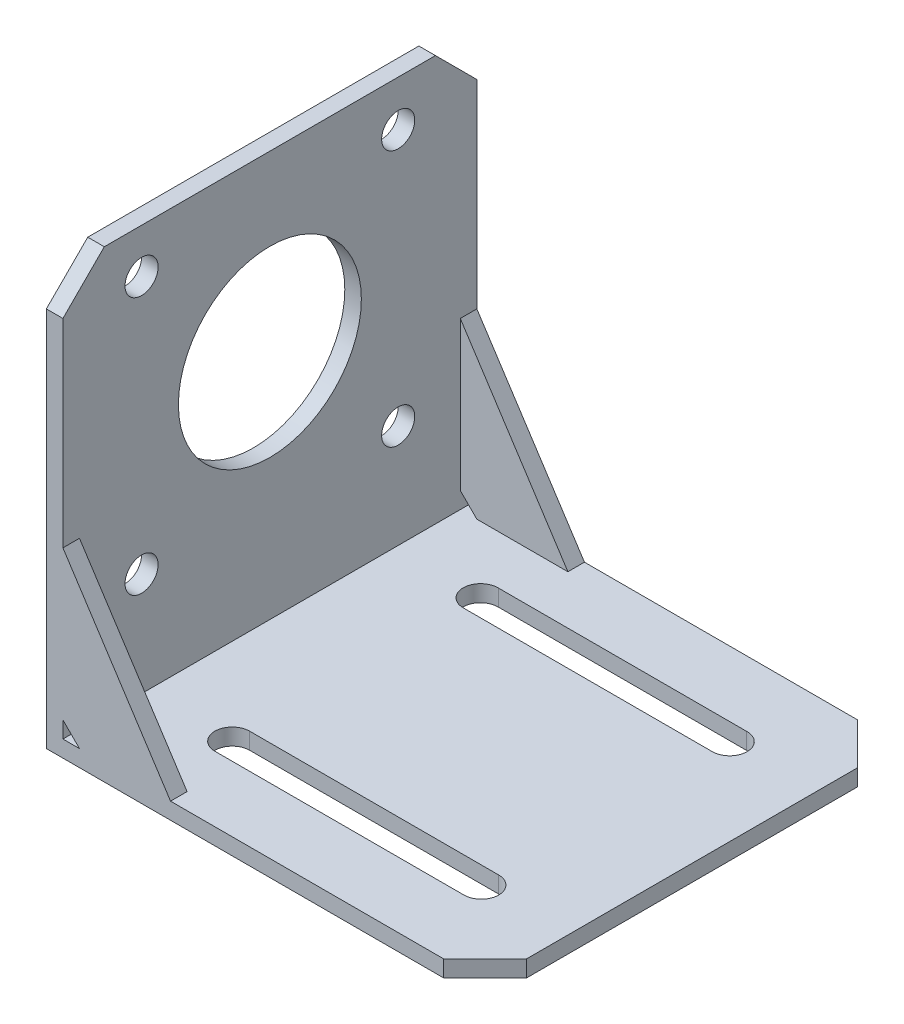
ISO-10303-21;
HEADER;
FILE_DESCRIPTION(('STEP AP214'),'2;1');
FILE_NAME('part.step','',(''),(''),'','','');
FILE_SCHEMA(('AUTOMOTIVE_DESIGN { 1 0 10303 214 1 1 1 1 }'));
ENDSEC;
DATA;
#1=APPLICATION_CONTEXT('core data for automotive mechanical design processes');
#2=APPLICATION_PROTOCOL_DEFINITION('international standard','automotive_design',2000,#1);
#3=PRODUCT_CONTEXT('',#1,'mechanical');
#4=PRODUCT('Part','Part','',(#3));
#5=PRODUCT_RELATED_PRODUCT_CATEGORY('part','',(#4));
#6=PRODUCT_DEFINITION_FORMATION('','',#4);
#7=PRODUCT_DEFINITION_CONTEXT('part definition',#1,'design');
#8=PRODUCT_DEFINITION('design','',#6,#7);
#9=PRODUCT_DEFINITION_SHAPE('','',#8);
#10=(LENGTH_UNIT() NAMED_UNIT(*) SI_UNIT(.MILLI.,.METRE.));
#11=(NAMED_UNIT(*) PLANE_ANGLE_UNIT() SI_UNIT($,.RADIAN.));
#12=(NAMED_UNIT(*) SI_UNIT($,.STERADIAN.) SOLID_ANGLE_UNIT());
#13=UNCERTAINTY_MEASURE_WITH_UNIT(LENGTH_MEASURE(1.E-05),#10,'distance_accuracy_value','');
#14=(GEOMETRIC_REPRESENTATION_CONTEXT(3) GLOBAL_UNCERTAINTY_ASSIGNED_CONTEXT((#13)) GLOBAL_UNIT_ASSIGNED_CONTEXT((#10,
#11,#12)) REPRESENTATION_CONTEXT('',''));
#15=CARTESIAN_POINT('',(0.,0.,0.));
#16=DIRECTION('',(0.,0.,1.));
#17=DIRECTION('',(1.,0.,0.));
#18=AXIS2_PLACEMENT_3D('',#15,#16,#17);
#19=CARTESIAN_POINT('',(53.,0.,50.));
#20=DIRECTION('',(0.,1.,0.));
#21=DIRECTION('',(-1.,0.,0.));
#22=AXIS2_PLACEMENT_3D('',#19,#20,#21);
#23=PLANE('',#22);
#24=DIRECTION('',(1.,0.,0.));
#25=VECTOR('',#24,1.);
#26=CARTESIAN_POINT('',(53.,0.,42.0995231668913));
#27=LINE('',#26,#25);
#28=CARTESIAN_POINT('',(12.5,0.,42.0995231668913));
#29=VERTEX_POINT('',#28);
#30=CARTESIAN_POINT('',(42.5,0.,42.0995231668913));
#31=VERTEX_POINT('',#30);
#32=EDGE_CURVE('E300',#29,#31,#27,.T.);
#33=ORIENTED_EDGE('',*,*,#32,.T.);
#34=CARTESIAN_POINT('',(42.5447489853135,0.,40.));
#35=DIRECTION('',(0.,1.,0.));
#36=DIRECTION('',(-1.,0.,0.));
#37=AXIS2_PLACEMENT_3D('',#34,#35,#36);
#38=CIRCLE('',#37,2.10000000000001);
#39=CARTESIAN_POINT('',(42.5447489853135,0.,37.9));
#40=VERTEX_POINT('',#39);
#41=EDGE_CURVE('E303',#31,#40,#38,.T.);
#42=ORIENTED_EDGE('',*,*,#41,.T.);
#43=DIRECTION('',(-1.,0.,0.));
#44=VECTOR('',#43,1.);
#45=CARTESIAN_POINT('',(53.,0.,37.9));
#46=LINE('',#45,#44);
#47=CARTESIAN_POINT('',(12.4552510146865,0.,37.9));
#48=VERTEX_POINT('',#47);
#49=EDGE_CURVE('E288',#40,#48,#46,.T.);
#50=ORIENTED_EDGE('',*,*,#49,.T.);
#51=CARTESIAN_POINT('',(12.4552510146873,0.,40.));
#52=DIRECTION('',(0.,1.,0.));
#53=DIRECTION('',(-1.,0.,0.));
#54=AXIS2_PLACEMENT_3D('',#51,#52,#53);
#55=CIRCLE('',#54,2.09999999999999);
#56=EDGE_CURVE('E297',#48,#29,#55,.T.);
#57=ORIENTED_EDGE('',*,*,#56,.T.);
#58=EDGE_LOOP('',(#33,#42,#50,#57));
#59=FACE_BOUND('',#58,.T.);
#60=DIRECTION('',(1.,0.,0.));
#61=VECTOR('',#60,1.);
#62=CARTESIAN_POINT('',(53.,0.,12.1));
#63=LINE('',#62,#61);
#64=CARTESIAN_POINT('',(12.4552510146865,0.,12.1));
#65=VERTEX_POINT('',#64);
#66=CARTESIAN_POINT('',(42.5447489853135,0.,12.1));
#67=VERTEX_POINT('',#66);
#68=EDGE_CURVE('E332',#65,#67,#63,.T.);
#69=ORIENTED_EDGE('',*,*,#68,.T.);
#70=CARTESIAN_POINT('',(42.5447489853135,0.,10.));
#71=DIRECTION('',(0.,1.,0.));
#72=DIRECTION('',(-1.,0.,0.));
#73=AXIS2_PLACEMENT_3D('',#70,#71,#72);
#74=CIRCLE('',#73,2.1);
#75=CARTESIAN_POINT('',(42.5,0.,7.90047683310867));
#76=VERTEX_POINT('',#75);
#77=EDGE_CURVE('E335',#67,#76,#74,.T.);
#78=ORIENTED_EDGE('',*,*,#77,.T.);
#79=DIRECTION('',(-1.,0.,0.));
#80=VECTOR('',#79,1.);
#81=CARTESIAN_POINT('',(53.,0.,7.90047683310866));
#82=LINE('',#81,#80);
#83=CARTESIAN_POINT('',(12.5,0.,7.90047683310867));
#84=VERTEX_POINT('',#83);
#85=EDGE_CURVE('E320',#76,#84,#82,.T.);
#86=ORIENTED_EDGE('',*,*,#85,.T.);
#87=CARTESIAN_POINT('',(12.4552510146861,0.,10.));
#88=DIRECTION('',(0.,1.,0.));
#89=DIRECTION('',(-1.,0.,0.));
#90=AXIS2_PLACEMENT_3D('',#87,#88,#89);
#91=CIRCLE('',#90,2.1);
#92=EDGE_CURVE('E329',#84,#65,#91,.T.);
#93=ORIENTED_EDGE('',*,*,#92,.T.);
#94=EDGE_LOOP('',(#69,#78,#86,#93));
#95=FACE_BOUND('',#94,.T.);
#96=DIRECTION('',(0.,0.,-1.));
#97=VECTOR('',#96,1.);
#98=CARTESIAN_POINT('',(53.,0.,50.));
#99=LINE('',#98,#97);
#100=CARTESIAN_POINT('',(53.,0.,45.));
#101=VERTEX_POINT('',#100);
#102=CARTESIAN_POINT('',(53.,0.,4.99999999999999));
#103=VERTEX_POINT('',#102);
#104=EDGE_CURVE('E399',#101,#103,#99,.T.);
#105=ORIENTED_EDGE('',*,*,#104,.F.);
#106=DIRECTION('',(0.707106781186547,0.,-0.707106781186549));
#107=VECTOR('',#106,1.);
#108=CARTESIAN_POINT('',(48.,0.,50.));
#109=LINE('',#108,#107);
#110=CARTESIAN_POINT('',(48.,0.,50.));
#111=VERTEX_POINT('',#110);
#112=EDGE_CURVE('E419',#101,#111,#109,.F.);
#113=ORIENTED_EDGE('',*,*,#112,.T.);
#114=DIRECTION('',(1.,0.,0.));
#115=VECTOR('',#114,1.);
#116=CARTESIAN_POINT('',(53.,0.,50.));
#117=LINE('',#116,#115);
#118=CARTESIAN_POINT('',(0.,0.,50.));
#119=VERTEX_POINT('',#118);
#120=EDGE_CURVE('E368',#119,#111,#117,.T.);
#121=ORIENTED_EDGE('',*,*,#120,.F.);
#122=DIRECTION('',(0.,0.,-1.));
#123=VECTOR('',#122,1.);
#124=CARTESIAN_POINT('',(0.,0.,50.));
#125=LINE('',#124,#123);
#126=CARTESIAN_POINT('',(0.,0.,0.));
#127=VERTEX_POINT('',#126);
#128=EDGE_CURVE('E381',#119,#127,#125,.T.);
#129=ORIENTED_EDGE('',*,*,#128,.T.);
#130=DIRECTION('',(1.,0.,0.));
#131=VECTOR('',#130,1.);
#132=CARTESIAN_POINT('',(53.,0.,0.));
#133=LINE('',#132,#131);
#134=CARTESIAN_POINT('',(48.,0.,0.));
#135=VERTEX_POINT('',#134);
#136=EDGE_CURVE('E216',#127,#135,#133,.T.);
#137=ORIENTED_EDGE('',*,*,#136,.T.);
#138=DIRECTION('',(0.707106781186549,0.,0.707106781186547));
#139=VECTOR('',#138,1.);
#140=CARTESIAN_POINT('',(53.,0.,4.99999999999999));
#141=LINE('',#140,#139);
#142=EDGE_CURVE('E417',#135,#103,#141,.T.);
#143=ORIENTED_EDGE('',*,*,#142,.T.);
#144=EDGE_LOOP('',(#105,#113,#121,#129,#137,#143));
#145=FACE_BOUND('',#144,.T.);
#146=ADVANCED_FACE('F32',(#59,#95,#145),#23,.F.);
#147=CARTESIAN_POINT('',(53.,2.,50.));
#148=DIRECTION('',(-1.,0.,0.));
#149=DIRECTION('',(0.,-1.,0.));
#150=AXIS2_PLACEMENT_3D('',#147,#148,#149);
#151=PLANE('',#150);
#152=DIRECTION('',(0.,0.,-1.));
#153=VECTOR('',#152,1.);
#154=CARTESIAN_POINT('',(53.,2.,50.));
#155=LINE('',#154,#153);
#156=CARTESIAN_POINT('',(53.,2.,45.));
#157=VERTEX_POINT('',#156);
#158=CARTESIAN_POINT('',(53.,2.,4.99999999999999));
#159=VERTEX_POINT('',#158);
#160=EDGE_CURVE('E396',#157,#159,#155,.T.);
#161=ORIENTED_EDGE('',*,*,#160,.F.);
#162=DIRECTION('',(0.,-1.,0.));
#163=VECTOR('',#162,1.);
#164=CARTESIAN_POINT('',(53.,2.,45.));
#165=LINE('',#164,#163);
#166=EDGE_CURVE('E415',#157,#101,#165,.T.);
#167=ORIENTED_EDGE('',*,*,#166,.T.);
#168=ORIENTED_EDGE('',*,*,#104,.T.);
#169=DIRECTION('',(0.,1.,0.));
#170=VECTOR('',#169,1.);
#171=CARTESIAN_POINT('',(53.,2.,4.99999999999999));
#172=LINE('',#171,#170);
#173=EDGE_CURVE('E412',#103,#159,#172,.T.);
#174=ORIENTED_EDGE('',*,*,#173,.T.);
#175=EDGE_LOOP('',(#161,#167,#168,#174));
#176=FACE_BOUND('',#175,.T.);
#177=ADVANCED_FACE('F492',(#176),#151,.F.);
#178=CARTESIAN_POINT('',(1.99999999999999,2.,50.));
#179=DIRECTION('',(0.,-1.,0.));
#180=DIRECTION('',(0.,0.,-1.));
#181=AXIS2_PLACEMENT_3D('',#178,#179,#180);
#182=PLANE('',#181);
#183=DIRECTION('',(-1.,0.,0.));
#184=VECTOR('',#183,1.);
#185=CARTESIAN_POINT('',(1.99999999999999,2.,50.));
#186=LINE('',#185,#184);
#187=CARTESIAN_POINT('',(48.,2.,50.));
#188=VERTEX_POINT('',#187);
#189=CARTESIAN_POINT('',(15.,2.,50.));
#190=VERTEX_POINT('',#189);
#191=EDGE_CURVE('E373',#188,#190,#186,.T.);
#192=ORIENTED_EDGE('',*,*,#191,.F.);
#193=DIRECTION('',(-0.707106781186547,0.,0.707106781186549));
#194=VECTOR('',#193,1.);
#195=CARTESIAN_POINT('',(48.,2.,50.));
#196=LINE('',#195,#194);
#197=EDGE_CURVE('E410',#188,#157,#196,.F.);
#198=ORIENTED_EDGE('',*,*,#197,.T.);
#199=ORIENTED_EDGE('',*,*,#160,.T.);
#200=DIRECTION('',(-0.707106781186549,0.,-0.707106781186547));
#201=VECTOR('',#200,1.);
#202=CARTESIAN_POINT('',(53.,2.,4.99999999999999));
#203=LINE('',#202,#201);
#204=CARTESIAN_POINT('',(48.,2.,0.));
#205=VERTEX_POINT('',#204);
#206=EDGE_CURVE('E408',#159,#205,#203,.T.);
#207=ORIENTED_EDGE('',*,*,#206,.T.);
#208=DIRECTION('',(-1.,0.,0.));
#209=VECTOR('',#208,1.);
#210=CARTESIAN_POINT('',(1.99999999999999,2.,0.));
#211=LINE('',#210,#209);
#212=CARTESIAN_POINT('',(15.,2.,0.));
#213=VERTEX_POINT('',#212);
#214=EDGE_CURVE('E215',#205,#213,#211,.T.);
#215=ORIENTED_EDGE('',*,*,#214,.T.);
#216=DIRECTION('',(0.,0.,-1.));
#217=VECTOR('',#216,1.);
#218=CARTESIAN_POINT('',(15.,2.,2.));
#219=LINE('',#218,#217);
#220=CARTESIAN_POINT('',(15.,2.,2.));
#221=VERTEX_POINT('',#220);
#222=EDGE_CURVE('E240',#221,#213,#219,.T.);
#223=ORIENTED_EDGE('',*,*,#222,.F.);
#224=DIRECTION('',(-1.,0.,0.));
#225=VECTOR('',#224,1.);
#226=CARTESIAN_POINT('',(15.,2.,2.));
#227=LINE('',#226,#225);
#228=CARTESIAN_POINT('',(3.99999999999999,2.,2.));
#229=VERTEX_POINT('',#228);
#230=EDGE_CURVE('E224',#221,#229,#227,.T.);
#231=ORIENTED_EDGE('',*,*,#230,.T.);
#232=DIRECTION('',(0.,0.,-1.));
#233=VECTOR('',#232,1.);
#234=CARTESIAN_POINT('',(3.99999999999999,2.,2.));
#235=LINE('',#234,#233);
#236=CARTESIAN_POINT('',(3.99999999999999,2.,0.));
#237=VERTEX_POINT('',#236);
#238=EDGE_CURVE('E219',#229,#237,#235,.T.);
#239=ORIENTED_EDGE('',*,*,#238,.T.);
#240=CARTESIAN_POINT('',(1.99999999999999,2.,0.));
#241=VERTEX_POINT('',#240);
#242=EDGE_CURVE('E205',#237,#241,#211,.T.);
#243=ORIENTED_EDGE('',*,*,#242,.T.);
#244=DIRECTION('',(0.,0.,-1.));
#245=VECTOR('',#244,1.);
#246=CARTESIAN_POINT('',(1.99999999999999,2.,50.));
#247=LINE('',#246,#245);
#248=CARTESIAN_POINT('',(1.99999999999999,2.,50.));
#249=VERTEX_POINT('',#248);
#250=EDGE_CURVE('E394',#249,#241,#247,.T.);
#251=ORIENTED_EDGE('',*,*,#250,.F.);
#252=CARTESIAN_POINT('',(3.99999999999999,2.,50.));
#253=VERTEX_POINT('',#252);
#254=EDGE_CURVE('E371',#253,#249,#186,.T.);
#255=ORIENTED_EDGE('',*,*,#254,.F.);
#256=DIRECTION('',(0.,0.,1.));
#257=VECTOR('',#256,1.);
#258=CARTESIAN_POINT('',(3.99999999999999,2.,48.));
#259=LINE('',#258,#257);
#260=CARTESIAN_POINT('',(3.99999999999999,2.,48.));
#261=VERTEX_POINT('',#260);
#262=EDGE_CURVE('E267',#261,#253,#259,.T.);
#263=ORIENTED_EDGE('',*,*,#262,.F.);
#264=DIRECTION('',(1.,0.,0.));
#265=VECTOR('',#264,1.);
#266=CARTESIAN_POINT('',(3.99999999999999,2.,48.));
#267=LINE('',#266,#265);
#268=CARTESIAN_POINT('',(15.,2.,48.));
#269=VERTEX_POINT('',#268);
#270=EDGE_CURVE('E257',#261,#269,#267,.T.);
#271=ORIENTED_EDGE('',*,*,#270,.T.);
#272=DIRECTION('',(0.,0.,1.));
#273=VECTOR('',#272,1.);
#274=CARTESIAN_POINT('',(15.,2.,48.));
#275=LINE('',#274,#273);
#276=EDGE_CURVE('E263',#269,#190,#275,.T.);
#277=ORIENTED_EDGE('',*,*,#276,.T.);
#278=EDGE_LOOP('',(#192,#198,#199,#207,#215,#223,#231,#239,#243,#251,#255,#263,#271,#277));
#279=FACE_BOUND('',#278,.T.);
#280=DIRECTION('',(-1.,0.,0.));
#281=VECTOR('',#280,1.);
#282=CARTESIAN_POINT('',(12.4552510146865,2.,37.9));
#283=LINE('',#282,#281);
#284=CARTESIAN_POINT('',(42.5447489853135,2.,37.9));
#285=VERTEX_POINT('',#284);
#286=CARTESIAN_POINT('',(12.4552510146865,2.,37.9));
#287=VERTEX_POINT('',#286);
#288=EDGE_CURVE('E276',#285,#287,#283,.T.);
#289=ORIENTED_EDGE('',*,*,#288,.F.);
#290=CARTESIAN_POINT('',(42.5447489853135,2.,40.));
#291=DIRECTION('',(0.,1.,0.));
#292=DIRECTION('',(0.,0.,-1.));
#293=AXIS2_PLACEMENT_3D('',#290,#291,#292);
#294=CIRCLE('',#293,2.10000000000001);
#295=CARTESIAN_POINT('',(42.5,2.,42.0995231668913));
#296=VERTEX_POINT('',#295);
#297=EDGE_CURVE('E266',#296,#285,#294,.T.);
#298=ORIENTED_EDGE('',*,*,#297,.F.);
#299=DIRECTION('',(1.,0.,0.));
#300=VECTOR('',#299,1.);
#301=CARTESIAN_POINT('',(12.5,2.,42.0995231668913));
#302=LINE('',#301,#300);
#303=CARTESIAN_POINT('',(12.5,2.,42.0995231668913));
#304=VERTEX_POINT('',#303);
#305=EDGE_CURVE('E282',#304,#296,#302,.T.);
#306=ORIENTED_EDGE('',*,*,#305,.F.);
#307=CARTESIAN_POINT('',(12.4552510146873,2.,40.));
#308=DIRECTION('',(0.,1.,0.));
#309=DIRECTION('',(0.,0.,-1.));
#310=AXIS2_PLACEMENT_3D('',#307,#308,#309);
#311=CIRCLE('',#310,2.09999999999999);
#312=EDGE_CURVE('E279',#287,#304,#311,.T.);
#313=ORIENTED_EDGE('',*,*,#312,.F.);
#314=EDGE_LOOP('',(#289,#298,#306,#313));
#315=FACE_BOUND('',#314,.T.);
#316=DIRECTION('',(-1.,0.,0.));
#317=VECTOR('',#316,1.);
#318=CARTESIAN_POINT('',(12.5,2.,7.90047683310867));
#319=LINE('',#318,#317);
#320=CARTESIAN_POINT('',(42.5,2.,7.90047683310866));
#321=VERTEX_POINT('',#320);
#322=CARTESIAN_POINT('',(12.5,2.,7.90047683310867));
#323=VERTEX_POINT('',#322);
#324=EDGE_CURVE('E308',#321,#323,#319,.T.);
#325=ORIENTED_EDGE('',*,*,#324,.F.);
#326=CARTESIAN_POINT('',(42.5447489853135,2.,10.));
#327=DIRECTION('',(0.,1.,0.));
#328=DIRECTION('',(0.,0.,-1.));
#329=AXIS2_PLACEMENT_3D('',#326,#327,#328);
#330=CIRCLE('',#329,2.1);
#331=CARTESIAN_POINT('',(42.5447489853135,2.,12.1));
#332=VERTEX_POINT('',#331);
#333=EDGE_CURVE('E306',#332,#321,#330,.T.);
#334=ORIENTED_EDGE('',*,*,#333,.F.);
#335=DIRECTION('',(1.,0.,0.));
#336=VECTOR('',#335,1.);
#337=CARTESIAN_POINT('',(12.4552510146865,2.,12.1));
#338=LINE('',#337,#336);
#339=CARTESIAN_POINT('',(12.4552510146865,2.,12.1));
#340=VERTEX_POINT('',#339);
#341=EDGE_CURVE('E314',#340,#332,#338,.T.);
#342=ORIENTED_EDGE('',*,*,#341,.F.);
#343=CARTESIAN_POINT('',(12.4552510146861,2.,10.));
#344=DIRECTION('',(0.,1.,0.));
#345=DIRECTION('',(0.,0.,-1.));
#346=AXIS2_PLACEMENT_3D('',#343,#344,#345);
#347=CIRCLE('',#346,2.1);
#348=EDGE_CURVE('E311',#323,#340,#347,.T.);
#349=ORIENTED_EDGE('',*,*,#348,.F.);
#350=EDGE_LOOP('',(#325,#334,#342,#349));
#351=FACE_BOUND('',#350,.T.);
#352=ADVANCED_FACE('F221',(#279,#315,#351),#182,.F.);
#353=CARTESIAN_POINT('',(1.99999999999999,51.,50.));
#354=DIRECTION('',(-1.,0.,0.));
#355=DIRECTION('',(0.,-1.,0.));
#356=AXIS2_PLACEMENT_3D('',#353,#354,#355);
#357=PLANE('',#356);
#358=DIRECTION('',(0.,0.,-1.));
#359=VECTOR('',#358,1.);
#360=CARTESIAN_POINT('',(1.99999999999999,51.,50.));
#361=LINE('',#360,#359);
#362=CARTESIAN_POINT('',(1.99999999999999,51.,45.));
#363=VERTEX_POINT('',#362);
#364=CARTESIAN_POINT('',(1.99999999999999,51.,4.99999999999999));
#365=VERTEX_POINT('',#364);
#366=EDGE_CURVE('E392',#363,#365,#361,.T.);
#367=ORIENTED_EDGE('',*,*,#366,.F.);
#368=DIRECTION('',(0.,0.707106781186547,-0.707106781186549));
#369=VECTOR('',#368,1.);
#370=CARTESIAN_POINT('',(1.99999999999999,46.,50.));
#371=LINE('',#370,#369);
#372=CARTESIAN_POINT('',(1.99999999999999,46.,50.));
#373=VERTEX_POINT('',#372);
#374=EDGE_CURVE('E11',#363,#373,#371,.F.);
#375=ORIENTED_EDGE('',*,*,#374,.T.);
#376=DIRECTION('',(0.,1.,0.));
#377=VECTOR('',#376,1.);
#378=CARTESIAN_POINT('',(1.99999999999999,51.,50.));
#379=LINE('',#378,#377);
#380=CARTESIAN_POINT('',(1.99999999999999,22.,50.));
#381=VERTEX_POINT('',#380);
#382=EDGE_CURVE('E375',#381,#373,#379,.T.);
#383=ORIENTED_EDGE('',*,*,#382,.F.);
#384=DIRECTION('',(0.,0.,1.));
#385=VECTOR('',#384,1.);
#386=CARTESIAN_POINT('',(1.99999999999999,22.,48.));
#387=LINE('',#386,#385);
#388=CARTESIAN_POINT('',(1.99999999999999,22.,48.));
#389=VERTEX_POINT('',#388);
#390=EDGE_CURVE('E260',#389,#381,#387,.T.);
#391=ORIENTED_EDGE('',*,*,#390,.F.);
#392=DIRECTION('',(0.,-1.,0.));
#393=VECTOR('',#392,1.);
#394=CARTESIAN_POINT('',(1.99999999999999,22.,48.));
#395=LINE('',#394,#393);
#396=CARTESIAN_POINT('',(2.,4.,48.));
#397=VERTEX_POINT('',#396);
#398=EDGE_CURVE('E251',#389,#397,#395,.T.);
#399=ORIENTED_EDGE('',*,*,#398,.T.);
#400=DIRECTION('',(0.,0.,1.));
#401=VECTOR('',#400,1.);
#402=CARTESIAN_POINT('',(2.,4.,48.));
#403=LINE('',#402,#401);
#404=CARTESIAN_POINT('',(2.,4.,50.));
#405=VERTEX_POINT('',#404);
#406=EDGE_CURVE('E270',#397,#405,#403,.T.);
#407=ORIENTED_EDGE('',*,*,#406,.T.);
#408=EDGE_CURVE('E376',#249,#405,#379,.T.);
#409=ORIENTED_EDGE('',*,*,#408,.F.);
#410=ORIENTED_EDGE('',*,*,#250,.T.);
#411=DIRECTION('',(0.,1.,0.));
#412=VECTOR('',#411,1.);
#413=CARTESIAN_POINT('',(1.99999999999999,51.,0.));
#414=LINE('',#413,#412);
#415=CARTESIAN_POINT('',(1.99999999999999,4.00000000000001,0.));
#416=VERTEX_POINT('',#415);
#417=EDGE_CURVE('E211',#241,#416,#414,.T.);
#418=ORIENTED_EDGE('',*,*,#417,.T.);
#419=DIRECTION('',(0.,0.,-1.));
#420=VECTOR('',#419,1.);
#421=CARTESIAN_POINT('',(1.99999999999999,4.,2.));
#422=LINE('',#421,#420);
#423=CARTESIAN_POINT('',(1.99999999999999,4.,2.));
#424=VERTEX_POINT('',#423);
#425=EDGE_CURVE('E228',#424,#416,#422,.T.);
#426=ORIENTED_EDGE('',*,*,#425,.F.);
#427=DIRECTION('',(0.,1.,0.));
#428=VECTOR('',#427,1.);
#429=CARTESIAN_POINT('',(1.99999999999999,4.,2.));
#430=LINE('',#429,#428);
#431=CARTESIAN_POINT('',(1.99999999999999,22.,2.));
#432=VERTEX_POINT('',#431);
#433=EDGE_CURVE('E466',#424,#432,#430,.T.);
#434=ORIENTED_EDGE('',*,*,#433,.T.);
#435=DIRECTION('',(0.,0.,-1.));
#436=VECTOR('',#435,1.);
#437=CARTESIAN_POINT('',(1.99999999999999,22.,2.));
#438=LINE('',#437,#436);
#439=CARTESIAN_POINT('',(1.99999999999999,22.,0.));
#440=VERTEX_POINT('',#439);
#441=EDGE_CURVE('E244',#432,#440,#438,.T.);
#442=ORIENTED_EDGE('',*,*,#441,.T.);
#443=CARTESIAN_POINT('',(1.99999999999999,46.,0.));
#444=VERTEX_POINT('',#443);
#445=EDGE_CURVE('E384',#440,#444,#414,.T.);
#446=ORIENTED_EDGE('',*,*,#445,.T.);
#447=DIRECTION('',(0.,0.707106781186549,0.707106781186547));
#448=VECTOR('',#447,1.);
#449=CARTESIAN_POINT('',(1.99999999999999,51.,4.99999999999999));
#450=LINE('',#449,#448);
#451=EDGE_CURVE('E40',#444,#365,#450,.T.);
#452=ORIENTED_EDGE('',*,*,#451,.T.);
#453=EDGE_LOOP('',(#367,#375,#383,#391,#399,#407,#409,#410,#418,#426,#434,#442,#446,#452));
#454=FACE_BOUND('',#453,.T.);
#455=CARTESIAN_POINT('',(1.99999999999999,45.6404459869094,40.5));
#456=DIRECTION('',(1.,0.,0.));
#457=DIRECTION('',(0.,1.,0.));
#458=AXIS2_PLACEMENT_3D('',#455,#456,#457);
#459=CIRCLE('',#458,2.);
#460=CARTESIAN_POINT('',(1.99999999999999,47.6404459869094,40.5));
#461=VERTEX_POINT('',#460);
#462=EDGE_CURVE('E343',#461,#461,#459,.T.);
#463=ORIENTED_EDGE('',*,*,#462,.F.);
#464=EDGE_LOOP('',(#463));
#465=FACE_BOUND('',#464,.T.);
#466=CARTESIAN_POINT('',(1.99999999999999,45.5,9.50000000000001));
#467=DIRECTION('',(1.,0.,0.));
#468=DIRECTION('',(0.,1.,0.));
#469=AXIS2_PLACEMENT_3D('',#466,#467,#468);
#470=CIRCLE('',#469,2.);
#471=CARTESIAN_POINT('',(1.99999999999999,47.5,9.50000000000001));
#472=VERTEX_POINT('',#471);
#473=EDGE_CURVE('E349',#472,#472,#470,.T.);
#474=ORIENTED_EDGE('',*,*,#473,.F.);
#475=EDGE_LOOP('',(#474));
#476=FACE_BOUND('',#475,.T.);
#477=CARTESIAN_POINT('',(1.99999999999999,14.5,40.5));
#478=DIRECTION('',(1.,0.,0.));
#479=DIRECTION('',(0.,1.,0.));
#480=AXIS2_PLACEMENT_3D('',#477,#478,#479);
#481=CIRCLE('',#480,2.);
#482=CARTESIAN_POINT('',(1.99999999999999,16.5,40.5));
#483=VERTEX_POINT('',#482);
#484=EDGE_CURVE('E355',#483,#483,#481,.T.);
#485=ORIENTED_EDGE('',*,*,#484,.F.);
#486=EDGE_LOOP('',(#485));
#487=FACE_BOUND('',#486,.T.);
#488=CARTESIAN_POINT('',(1.99999999999999,14.5,9.5));
#489=DIRECTION('',(1.,0.,0.));
#490=DIRECTION('',(0.,1.,0.));
#491=AXIS2_PLACEMENT_3D('',#488,#489,#490);
#492=CIRCLE('',#491,2.);
#493=CARTESIAN_POINT('',(1.99999999999999,16.5,9.5));
#494=VERTEX_POINT('',#493);
#495=EDGE_CURVE('E338',#494,#494,#492,.T.);
#496=ORIENTED_EDGE('',*,*,#495,.F.);
#497=EDGE_LOOP('',(#496));
#498=FACE_BOUND('',#497,.T.);
#499=CARTESIAN_POINT('',(1.99999999999999,30.,25.));
#500=DIRECTION('',(1.,0.,0.));
#501=DIRECTION('',(0.,1.,0.));
#502=AXIS2_PLACEMENT_3D('',#499,#500,#501);
#503=CIRCLE('',#502,11.05);
#504=CARTESIAN_POINT('',(1.99999999999999,41.05,25.));
#505=VERTEX_POINT('',#504);
#506=EDGE_CURVE('E342',#505,#505,#503,.T.);
#507=ORIENTED_EDGE('',*,*,#506,.F.);
#508=EDGE_LOOP('',(#507));
#509=FACE_BOUND('',#508,.T.);
#510=ADVANCED_FACE('F451',(#454,#465,#476,#487,#498,#509),#357,.F.);
#511=CARTESIAN_POINT('',(0.,51.,50.));
#512=DIRECTION('',(0.,-1.,0.));
#513=DIRECTION('',(0.,0.,-1.));
#514=AXIS2_PLACEMENT_3D('',#511,#512,#513);
#515=PLANE('',#514);
#516=DIRECTION('',(0.,0.,-1.));
#517=VECTOR('',#516,1.);
#518=CARTESIAN_POINT('',(0.,51.,50.));
#519=LINE('',#518,#517);
#520=CARTESIAN_POINT('',(0.,51.,45.));
#521=VERTEX_POINT('',#520);
#522=CARTESIAN_POINT('',(0.,51.,4.99999999999999));
#523=VERTEX_POINT('',#522);
#524=EDGE_CURVE('E389',#521,#523,#519,.T.);
#525=ORIENTED_EDGE('',*,*,#524,.F.);
#526=DIRECTION('',(1.,0.,0.));
#527=VECTOR('',#526,1.);
#528=CARTESIAN_POINT('',(0.,51.,45.));
#529=LINE('',#528,#527);
#530=EDGE_CURVE('E53',#521,#363,#529,.T.);
#531=ORIENTED_EDGE('',*,*,#530,.T.);
#532=ORIENTED_EDGE('',*,*,#366,.T.);
#533=DIRECTION('',(-1.,0.,0.));
#534=VECTOR('',#533,1.);
#535=CARTESIAN_POINT('',(0.,51.,4.99999999999999));
#536=LINE('',#535,#534);
#537=EDGE_CURVE('E429',#365,#523,#536,.T.);
#538=ORIENTED_EDGE('',*,*,#537,.T.);
#539=EDGE_LOOP('',(#525,#531,#532,#538));
#540=FACE_BOUND('',#539,.T.);
#541=ADVANCED_FACE('F433',(#540),#515,.F.);
#542=CARTESIAN_POINT('',(0.,0.,50.));
#543=DIRECTION('',(1.,0.,0.));
#544=DIRECTION('',(0.,1.,0.));
#545=AXIS2_PLACEMENT_3D('',#542,#543,#544);
#546=PLANE('',#545);
#547=CARTESIAN_POINT('',(0.,45.6404459869094,40.5));
#548=DIRECTION('',(1.,0.,0.));
#549=DIRECTION('',(0.,1.,0.));
#550=AXIS2_PLACEMENT_3D('',#547,#548,#549);
#551=CIRCLE('',#550,2.);
#552=CARTESIAN_POINT('',(0.,47.6404459869094,40.5));
#553=VERTEX_POINT('',#552);
#554=EDGE_CURVE('E339',#553,#553,#551,.T.);
#555=ORIENTED_EDGE('',*,*,#554,.T.);
#556=EDGE_LOOP('',(#555));
#557=FACE_BOUND('',#556,.T.);
#558=CARTESIAN_POINT('',(0.,45.5,9.50000000000001));
#559=DIRECTION('',(1.,0.,0.));
#560=DIRECTION('',(0.,1.,0.));
#561=AXIS2_PLACEMENT_3D('',#558,#559,#560);
#562=CIRCLE('',#561,2.);
#563=CARTESIAN_POINT('',(0.,47.5,9.50000000000001));
#564=VERTEX_POINT('',#563);
#565=EDGE_CURVE('E346',#564,#564,#562,.T.);
#566=ORIENTED_EDGE('',*,*,#565,.T.);
#567=EDGE_LOOP('',(#566));
#568=FACE_BOUND('',#567,.T.);
#569=CARTESIAN_POINT('',(0.,14.5,40.5));
#570=DIRECTION('',(1.,0.,0.));
#571=DIRECTION('',(0.,1.,0.));
#572=AXIS2_PLACEMENT_3D('',#569,#570,#571);
#573=CIRCLE('',#572,2.);
#574=CARTESIAN_POINT('',(0.,16.5,40.5));
#575=VERTEX_POINT('',#574);
#576=EDGE_CURVE('E352',#575,#575,#573,.T.);
#577=ORIENTED_EDGE('',*,*,#576,.T.);
#578=EDGE_LOOP('',(#577));
#579=FACE_BOUND('',#578,.T.);
#580=CARTESIAN_POINT('',(0.,14.5,9.5));
#581=DIRECTION('',(1.,0.,0.));
#582=DIRECTION('',(0.,1.,0.));
#583=AXIS2_PLACEMENT_3D('',#580,#581,#582);
#584=CIRCLE('',#583,2.);
#585=CARTESIAN_POINT('',(0.,16.5,9.5));
#586=VERTEX_POINT('',#585);
#587=EDGE_CURVE('E358',#586,#586,#584,.T.);
#588=ORIENTED_EDGE('',*,*,#587,.T.);
#589=EDGE_LOOP('',(#588));
#590=FACE_BOUND('',#589,.T.);
#591=CARTESIAN_POINT('',(0.,30.,25.));
#592=DIRECTION('',(1.,0.,0.));
#593=DIRECTION('',(0.,1.,0.));
#594=AXIS2_PLACEMENT_3D('',#591,#592,#593);
#595=CIRCLE('',#594,11.05);
#596=CARTESIAN_POINT('',(0.,41.05,25.));
#597=VERTEX_POINT('',#596);
#598=EDGE_CURVE('E363',#597,#597,#595,.T.);
#599=ORIENTED_EDGE('',*,*,#598,.T.);
#600=EDGE_LOOP('',(#599));
#601=FACE_BOUND('',#600,.T.);
#602=DIRECTION('',(0.,-1.,0.));
#603=VECTOR('',#602,1.);
#604=CARTESIAN_POINT('',(0.,0.,50.));
#605=LINE('',#604,#603);
#606=CARTESIAN_POINT('',(0.,46.,50.));
#607=VERTEX_POINT('',#606);
#608=EDGE_CURVE('E379',#607,#119,#605,.T.);
#609=ORIENTED_EDGE('',*,*,#608,.F.);
#610=DIRECTION('',(0.,-0.707106781186547,0.707106781186549));
#611=VECTOR('',#610,1.);
#612=CARTESIAN_POINT('',(0.,46.,50.));
#613=LINE('',#612,#611);
#614=EDGE_CURVE('E427',#607,#521,#613,.F.);
#615=ORIENTED_EDGE('',*,*,#614,.T.);
#616=ORIENTED_EDGE('',*,*,#524,.T.);
#617=DIRECTION('',(0.,-0.707106781186549,-0.707106781186547));
#618=VECTOR('',#617,1.);
#619=CARTESIAN_POINT('',(0.,51.,4.99999999999999));
#620=LINE('',#619,#618);
#621=CARTESIAN_POINT('',(0.,46.,0.));
#622=VERTEX_POINT('',#621);
#623=EDGE_CURVE('E425',#523,#622,#620,.T.);
#624=ORIENTED_EDGE('',*,*,#623,.T.);
#625=DIRECTION('',(0.,-1.,0.));
#626=VECTOR('',#625,1.);
#627=CARTESIAN_POINT('',(0.,0.,0.));
#628=LINE('',#627,#626);
#629=EDGE_CURVE('E372',#622,#127,#628,.T.);
#630=ORIENTED_EDGE('',*,*,#629,.T.);
#631=ORIENTED_EDGE('',*,*,#128,.F.);
#632=EDGE_LOOP('',(#609,#615,#616,#624,#630,#631));
#633=FACE_BOUND('',#632,.T.);
#634=ADVANCED_FACE('F437',(#557,#568,#579,#590,#601,#633),#546,.F.);
#635=CARTESIAN_POINT('',(0.,0.,50.));
#636=DIRECTION('',(0.,0.,-1.));
#637=DIRECTION('',(-1.,0.,0.));
#638=AXIS2_PLACEMENT_3D('',#635,#636,#637);
#639=PLANE('',#638);
#640=ORIENTED_EDGE('',*,*,#120,.T.);
#641=DIRECTION('',(0.,1.,0.));
#642=VECTOR('',#641,1.);
#643=CARTESIAN_POINT('',(48.,1.66533453693774E-13,50.));
#644=LINE('',#643,#642);
#645=EDGE_CURVE('E405',#111,#188,#644,.T.);
#646=ORIENTED_EDGE('',*,*,#645,.T.);
#647=ORIENTED_EDGE('',*,*,#191,.T.);
#648=DIRECTION('',(-0.544988350595414,0.838443616300637,0.));
#649=VECTOR('',#648,1.);
#650=CARTESIAN_POINT('',(15.,2.,50.));
#651=LINE('',#650,#649);
#652=EDGE_CURVE('E243',#190,#381,#651,.T.);
#653=ORIENTED_EDGE('',*,*,#652,.T.);
#654=ORIENTED_EDGE('',*,*,#382,.T.);
#655=DIRECTION('',(-1.,0.,0.));
#656=VECTOR('',#655,1.);
#657=CARTESIAN_POINT('',(0.,46.,50.));
#658=LINE('',#657,#656);
#659=EDGE_CURVE('E402',#373,#607,#658,.T.);
#660=ORIENTED_EDGE('',*,*,#659,.T.);
#661=ORIENTED_EDGE('',*,*,#608,.T.);
#662=EDGE_LOOP('',(#640,#646,#647,#653,#654,#660,#661));
#663=FACE_BOUND('',#662,.T.);
#664=DIRECTION('',(0.707106781186547,-0.707106781186548,0.));
#665=VECTOR('',#664,1.);
#666=CARTESIAN_POINT('',(2.,4.,50.));
#667=LINE('',#666,#665);
#668=EDGE_CURVE('E252',#405,#253,#667,.T.);
#669=ORIENTED_EDGE('',*,*,#668,.T.);
#670=ORIENTED_EDGE('',*,*,#254,.T.);
#671=ORIENTED_EDGE('',*,*,#408,.T.);
#672=EDGE_LOOP('',(#669,#670,#671));
#673=FACE_BOUND('',#672,.T.);
#674=ADVANCED_FACE('F446',(#663,#673),#639,.F.);
#675=CARTESIAN_POINT('',(0.,0.,0.));
#676=DIRECTION('',(0.,0.,-1.));
#677=DIRECTION('',(-1.,0.,0.));
#678=AXIS2_PLACEMENT_3D('',#675,#676,#677);
#679=PLANE('',#678);
#680=ORIENTED_EDGE('',*,*,#242,.F.);
#681=DIRECTION('',(-0.707106781186548,0.707106781186547,0.));
#682=VECTOR('',#681,1.);
#683=CARTESIAN_POINT('',(3.99999999999999,2.,0.));
#684=LINE('',#683,#682);
#685=EDGE_CURVE('E210',#237,#416,#684,.T.);
#686=ORIENTED_EDGE('',*,*,#685,.T.);
#687=ORIENTED_EDGE('',*,*,#417,.F.);
#688=EDGE_LOOP('',(#680,#686,#687));
#689=FACE_BOUND('',#688,.T.);
#690=ORIENTED_EDGE('',*,*,#214,.F.);
#691=DIRECTION('',(0.,-1.,0.));
#692=VECTOR('',#691,1.);
#693=CARTESIAN_POINT('',(48.,0.,0.));
#694=LINE('',#693,#692);
#695=EDGE_CURVE('E423',#205,#135,#694,.T.);
#696=ORIENTED_EDGE('',*,*,#695,.T.);
#697=ORIENTED_EDGE('',*,*,#136,.F.);
#698=ORIENTED_EDGE('',*,*,#629,.F.);
#699=DIRECTION('',(1.,0.,0.));
#700=VECTOR('',#699,1.);
#701=CARTESIAN_POINT('',(1.99999999999999,46.,0.));
#702=LINE('',#701,#700);
#703=EDGE_CURVE('E421',#622,#444,#702,.T.);
#704=ORIENTED_EDGE('',*,*,#703,.T.);
#705=ORIENTED_EDGE('',*,*,#445,.F.);
#706=DIRECTION('',(0.544988350595414,-0.838443616300637,0.));
#707=VECTOR('',#706,1.);
#708=CARTESIAN_POINT('',(1.99999999999999,22.,0.));
#709=LINE('',#708,#707);
#710=EDGE_CURVE('E233',#440,#213,#709,.T.);
#711=ORIENTED_EDGE('',*,*,#710,.T.);
#712=EDGE_LOOP('',(#690,#696,#697,#698,#704,#705,#711));
#713=FACE_BOUND('',#712,.T.);
#714=ADVANCED_FACE('F207',(#689,#713),#679,.T.);
#715=CARTESIAN_POINT('',(0.,30.,25.));
#716=DIRECTION('',(1.,0.,0.));
#717=DIRECTION('',(0.,1.,0.));
#718=AXIS2_PLACEMENT_3D('',#715,#716,#717);
#719=CYLINDRICAL_SURFACE('',#718,11.05);
#720=ORIENTED_EDGE('',*,*,#598,.F.);
#721=EDGE_LOOP('',(#720));
#722=FACE_BOUND('',#721,.T.);
#723=ORIENTED_EDGE('',*,*,#506,.T.);
#724=EDGE_LOOP('',(#723));
#725=FACE_BOUND('',#724,.T.);
#726=ADVANCED_FACE('F524',(#722,#725),#719,.F.);
#727=CARTESIAN_POINT('',(0.,14.5,9.5));
#728=DIRECTION('',(1.,0.,0.));
#729=DIRECTION('',(0.,1.,0.));
#730=AXIS2_PLACEMENT_3D('',#727,#728,#729);
#731=CYLINDRICAL_SURFACE('',#730,2.);
#732=ORIENTED_EDGE('',*,*,#587,.F.);
#733=EDGE_LOOP('',(#732));
#734=FACE_BOUND('',#733,.T.);
#735=ORIENTED_EDGE('',*,*,#495,.T.);
#736=EDGE_LOOP('',(#735));
#737=FACE_BOUND('',#736,.T.);
#738=ADVANCED_FACE('F529',(#734,#737),#731,.F.);
#739=CARTESIAN_POINT('',(0.,14.5,40.5));
#740=DIRECTION('',(1.,0.,0.));
#741=DIRECTION('',(0.,1.,0.));
#742=AXIS2_PLACEMENT_3D('',#739,#740,#741);
#743=CYLINDRICAL_SURFACE('',#742,2.);
#744=ORIENTED_EDGE('',*,*,#576,.F.);
#745=EDGE_LOOP('',(#744));
#746=FACE_BOUND('',#745,.T.);
#747=ORIENTED_EDGE('',*,*,#484,.T.);
#748=EDGE_LOOP('',(#747));
#749=FACE_BOUND('',#748,.T.);
#750=ADVANCED_FACE('F533',(#746,#749),#743,.F.);
#751=CARTESIAN_POINT('',(0.,45.5,9.50000000000001));
#752=DIRECTION('',(1.,0.,0.));
#753=DIRECTION('',(0.,1.,0.));
#754=AXIS2_PLACEMENT_3D('',#751,#752,#753);
#755=CYLINDRICAL_SURFACE('',#754,2.);
#756=ORIENTED_EDGE('',*,*,#565,.F.);
#757=EDGE_LOOP('',(#756));
#758=FACE_BOUND('',#757,.T.);
#759=ORIENTED_EDGE('',*,*,#473,.T.);
#760=EDGE_LOOP('',(#759));
#761=FACE_BOUND('',#760,.T.);
#762=ADVANCED_FACE('F537',(#758,#761),#755,.F.);
#763=CARTESIAN_POINT('',(0.,45.6404459869094,40.5));
#764=DIRECTION('',(1.,0.,0.));
#765=DIRECTION('',(0.,1.,0.));
#766=AXIS2_PLACEMENT_3D('',#763,#764,#765);
#767=CYLINDRICAL_SURFACE('',#766,2.);
#768=ORIENTED_EDGE('',*,*,#554,.F.);
#769=EDGE_LOOP('',(#768));
#770=FACE_BOUND('',#769,.T.);
#771=ORIENTED_EDGE('',*,*,#462,.T.);
#772=EDGE_LOOP('',(#771));
#773=FACE_BOUND('',#772,.T.);
#774=ADVANCED_FACE('F541',(#770,#773),#767,.F.);
#775=CARTESIAN_POINT('',(42.5447489853135,-48.,10.));
#776=DIRECTION('',(0.,1.,0.));
#777=DIRECTION('',(0.,0.,1.));
#778=AXIS2_PLACEMENT_3D('',#775,#776,#777);
#779=CYLINDRICAL_SURFACE('',#778,2.1);
#780=DIRECTION('',(0.,1.,0.));
#781=VECTOR('',#780,1.);
#782=CARTESIAN_POINT('',(42.5447489853135,-48.,12.1));
#783=LINE('',#782,#781);
#784=EDGE_CURVE('E318',#67,#332,#783,.T.);
#785=ORIENTED_EDGE('',*,*,#784,.T.);
#786=ORIENTED_EDGE('',*,*,#333,.T.);
#787=DIRECTION('',(0.,1.,0.));
#788=VECTOR('',#787,1.);
#789=CARTESIAN_POINT('',(42.5,-48.,7.90047683310867));
#790=LINE('',#789,#788);
#791=EDGE_CURVE('E317',#76,#321,#790,.T.);
#792=ORIENTED_EDGE('',*,*,#791,.F.);
#793=ORIENTED_EDGE('',*,*,#77,.F.);
#794=EDGE_LOOP('',(#785,#786,#792,#793));
#795=FACE_BOUND('',#794,.T.);
#796=ADVANCED_FACE('F545',(#795),#779,.F.);
#797=CARTESIAN_POINT('',(12.4552510146865,-48.,12.1));
#798=DIRECTION('',(0.,0.,1.));
#799=DIRECTION('',(1.,0.,0.));
#800=AXIS2_PLACEMENT_3D('',#797,#798,#799);
#801=PLANE('',#800);
#802=DIRECTION('',(0.,1.,0.));
#803=VECTOR('',#802,1.);
#804=CARTESIAN_POINT('',(12.4552510146865,-48.,12.1));
#805=LINE('',#804,#803);
#806=EDGE_CURVE('E321',#65,#340,#805,.T.);
#807=ORIENTED_EDGE('',*,*,#806,.T.);
#808=ORIENTED_EDGE('',*,*,#341,.T.);
#809=ORIENTED_EDGE('',*,*,#784,.F.);
#810=ORIENTED_EDGE('',*,*,#68,.F.);
#811=EDGE_LOOP('',(#807,#808,#809,#810));
#812=FACE_BOUND('',#811,.T.);
#813=ADVANCED_FACE('F549',(#812),#801,.F.);
#814=CARTESIAN_POINT('',(12.4552510146861,-48.,10.));
#815=DIRECTION('',(0.,1.,0.));
#816=DIRECTION('',(0.,0.,1.));
#817=AXIS2_PLACEMENT_3D('',#814,#815,#816);
#818=CYLINDRICAL_SURFACE('',#817,2.1);
#819=DIRECTION('',(0.,1.,0.));
#820=VECTOR('',#819,1.);
#821=CARTESIAN_POINT('',(12.5,-48.,7.90047683310867));
#822=LINE('',#821,#820);
#823=EDGE_CURVE('E323',#84,#323,#822,.T.);
#824=ORIENTED_EDGE('',*,*,#823,.T.);
#825=ORIENTED_EDGE('',*,*,#348,.T.);
#826=ORIENTED_EDGE('',*,*,#806,.F.);
#827=ORIENTED_EDGE('',*,*,#92,.F.);
#828=EDGE_LOOP('',(#824,#825,#826,#827));
#829=FACE_BOUND('',#828,.T.);
#830=ADVANCED_FACE('F555',(#829),#818,.F.);
#831=CARTESIAN_POINT('',(12.5,-48.,7.90047683310867));
#832=DIRECTION('',(0.,0.,-1.));
#833=DIRECTION('',(-1.,0.,0.));
#834=AXIS2_PLACEMENT_3D('',#831,#832,#833);
#835=PLANE('',#834);
#836=ORIENTED_EDGE('',*,*,#791,.T.);
#837=ORIENTED_EDGE('',*,*,#324,.T.);
#838=ORIENTED_EDGE('',*,*,#823,.F.);
#839=ORIENTED_EDGE('',*,*,#85,.F.);
#840=EDGE_LOOP('',(#836,#837,#838,#839));
#841=FACE_BOUND('',#840,.T.);
#842=ADVANCED_FACE('F551',(#841),#835,.F.);
#843=CARTESIAN_POINT('',(42.5447489853135,-48.,40.));
#844=DIRECTION('',(0.,1.,0.));
#845=DIRECTION('',(0.,0.,1.));
#846=AXIS2_PLACEMENT_3D('',#843,#844,#845);
#847=CYLINDRICAL_SURFACE('',#846,2.10000000000001);
#848=DIRECTION('',(0.,1.,0.));
#849=VECTOR('',#848,1.);
#850=CARTESIAN_POINT('',(42.5,-48.,42.0995231668913));
#851=LINE('',#850,#849);
#852=EDGE_CURVE('E286',#31,#296,#851,.T.);
#853=ORIENTED_EDGE('',*,*,#852,.T.);
#854=ORIENTED_EDGE('',*,*,#297,.T.);
#855=DIRECTION('',(0.,1.,0.));
#856=VECTOR('',#855,1.);
#857=CARTESIAN_POINT('',(42.5447489853135,-48.,37.9));
#858=LINE('',#857,#856);
#859=EDGE_CURVE('E285',#40,#285,#858,.T.);
#860=ORIENTED_EDGE('',*,*,#859,.F.);
#861=ORIENTED_EDGE('',*,*,#41,.F.);
#862=EDGE_LOOP('',(#853,#854,#860,#861));
#863=FACE_BOUND('',#862,.T.);
#864=ADVANCED_FACE('F554',(#863),#847,.F.);
#865=CARTESIAN_POINT('',(12.5,-48.,42.0995231668913));
#866=DIRECTION('',(0.,0.,1.));
#867=DIRECTION('',(1.,0.,0.));
#868=AXIS2_PLACEMENT_3D('',#865,#866,#867);
#869=PLANE('',#868);
#870=DIRECTION('',(0.,1.,0.));
#871=VECTOR('',#870,1.);
#872=CARTESIAN_POINT('',(12.5,-48.,42.0995231668913));
#873=LINE('',#872,#871);
#874=EDGE_CURVE('E289',#29,#304,#873,.T.);
#875=ORIENTED_EDGE('',*,*,#874,.T.);
#876=ORIENTED_EDGE('',*,*,#305,.T.);
#877=ORIENTED_EDGE('',*,*,#852,.F.);
#878=ORIENTED_EDGE('',*,*,#32,.F.);
#879=EDGE_LOOP('',(#875,#876,#877,#878));
#880=FACE_BOUND('',#879,.T.);
#881=ADVANCED_FACE('F565',(#880),#869,.F.);
#882=CARTESIAN_POINT('',(12.4552510146873,-48.,40.));
#883=DIRECTION('',(0.,1.,0.));
#884=DIRECTION('',(0.,0.,1.));
#885=AXIS2_PLACEMENT_3D('',#882,#883,#884);
#886=CYLINDRICAL_SURFACE('',#885,2.09999999999999);
#887=DIRECTION('',(0.,1.,0.));
#888=VECTOR('',#887,1.);
#889=CARTESIAN_POINT('',(12.4552510146865,-48.,37.9));
#890=LINE('',#889,#888);
#891=EDGE_CURVE('E291',#48,#287,#890,.T.);
#892=ORIENTED_EDGE('',*,*,#891,.T.);
#893=ORIENTED_EDGE('',*,*,#312,.T.);
#894=ORIENTED_EDGE('',*,*,#874,.F.);
#895=ORIENTED_EDGE('',*,*,#56,.F.);
#896=EDGE_LOOP('',(#892,#893,#894,#895));
#897=FACE_BOUND('',#896,.T.);
#898=ADVANCED_FACE('F570',(#897),#886,.F.);
#899=CARTESIAN_POINT('',(12.4552510146865,-48.,37.9));
#900=DIRECTION('',(0.,0.,-1.));
#901=DIRECTION('',(-1.,0.,0.));
#902=AXIS2_PLACEMENT_3D('',#899,#900,#901);
#903=PLANE('',#902);
#904=ORIENTED_EDGE('',*,*,#859,.T.);
#905=ORIENTED_EDGE('',*,*,#288,.T.);
#906=ORIENTED_EDGE('',*,*,#891,.F.);
#907=ORIENTED_EDGE('',*,*,#49,.F.);
#908=EDGE_LOOP('',(#904,#905,#906,#907));
#909=FACE_BOUND('',#908,.T.);
#910=ADVANCED_FACE('F567',(#909),#903,.F.);
#911=CARTESIAN_POINT('',(15.,2.,48.));
#912=DIRECTION('',(0.838443616300637,0.544988350595414,0.));
#913=DIRECTION('',(-0.544988350595414,0.838443616300637,0.));
#914=AXIS2_PLACEMENT_3D('',#911,#912,#913);
#915=PLANE('',#914);
#916=ORIENTED_EDGE('',*,*,#652,.F.);
#917=ORIENTED_EDGE('',*,*,#276,.F.);
#918=DIRECTION('',(-0.544988350595414,0.838443616300637,0.));
#919=VECTOR('',#918,1.);
#920=CARTESIAN_POINT('',(15.,2.,48.));
#921=LINE('',#920,#919);
#922=EDGE_CURVE('E248',#269,#389,#921,.T.);
#923=ORIENTED_EDGE('',*,*,#922,.T.);
#924=ORIENTED_EDGE('',*,*,#390,.T.);
#925=EDGE_LOOP('',(#916,#917,#923,#924));
#926=FACE_BOUND('',#925,.T.);
#927=ADVANCED_FACE('F454',(#926),#915,.T.);
#928=CARTESIAN_POINT('',(2.,4.,48.));
#929=DIRECTION('',(-0.707106781186548,-0.707106781186547,0.));
#930=DIRECTION('',(0.707106781186547,-0.707106781186548,0.));
#931=AXIS2_PLACEMENT_3D('',#928,#929,#930);
#932=PLANE('',#931);
#933=ORIENTED_EDGE('',*,*,#668,.F.);
#934=ORIENTED_EDGE('',*,*,#406,.F.);
#935=DIRECTION('',(0.707106781186547,-0.707106781186548,0.));
#936=VECTOR('',#935,1.);
#937=CARTESIAN_POINT('',(2.,4.,48.));
#938=LINE('',#937,#936);
#939=EDGE_CURVE('E255',#397,#261,#938,.T.);
#940=ORIENTED_EDGE('',*,*,#939,.T.);
#941=ORIENTED_EDGE('',*,*,#262,.T.);
#942=EDGE_LOOP('',(#933,#934,#940,#941));
#943=FACE_BOUND('',#942,.T.);
#944=ADVANCED_FACE('F463',(#943),#932,.T.);
#945=CARTESIAN_POINT('',(0.,0.,48.));
#946=DIRECTION('',(0.,0.,-1.));
#947=DIRECTION('',(-1.,0.,0.));
#948=AXIS2_PLACEMENT_3D('',#945,#946,#947);
#949=PLANE('',#948);
#950=ORIENTED_EDGE('',*,*,#922,.F.);
#951=ORIENTED_EDGE('',*,*,#270,.F.);
#952=ORIENTED_EDGE('',*,*,#939,.F.);
#953=ORIENTED_EDGE('',*,*,#398,.F.);
#954=EDGE_LOOP('',(#950,#951,#952,#953));
#955=FACE_BOUND('',#954,.T.);
#956=ADVANCED_FACE('F458',(#955),#949,.T.);
#957=CARTESIAN_POINT('',(1.99999999999999,22.,2.));
#958=DIRECTION('',(0.838443616300637,0.544988350595414,0.));
#959=DIRECTION('',(-0.544988350595414,0.838443616300637,0.));
#960=AXIS2_PLACEMENT_3D('',#957,#958,#959);
#961=PLANE('',#960);
#962=ORIENTED_EDGE('',*,*,#710,.F.);
#963=ORIENTED_EDGE('',*,*,#441,.F.);
#964=DIRECTION('',(0.544988350595414,-0.838443616300637,0.));
#965=VECTOR('',#964,1.);
#966=CARTESIAN_POINT('',(1.99999999999999,22.,2.));
#967=LINE('',#966,#965);
#968=EDGE_CURVE('E229',#432,#221,#967,.T.);
#969=ORIENTED_EDGE('',*,*,#968,.T.);
#970=ORIENTED_EDGE('',*,*,#222,.T.);
#971=EDGE_LOOP('',(#962,#963,#969,#970));
#972=FACE_BOUND('',#971,.T.);
#973=ADVANCED_FACE('F477',(#972),#961,.T.);
#974=CARTESIAN_POINT('',(3.99999999999999,2.,2.));
#975=DIRECTION('',(-0.707106781186547,-0.707106781186548,0.));
#976=DIRECTION('',(0.707106781186548,-0.707106781186547,0.));
#977=AXIS2_PLACEMENT_3D('',#974,#975,#976);
#978=PLANE('',#977);
#979=ORIENTED_EDGE('',*,*,#685,.F.);
#980=ORIENTED_EDGE('',*,*,#238,.F.);
#981=DIRECTION('',(-0.707106781186548,0.707106781186547,0.));
#982=VECTOR('',#981,1.);
#983=CARTESIAN_POINT('',(3.99999999999999,2.,2.));
#984=LINE('',#983,#982);
#985=EDGE_CURVE('E471',#229,#424,#984,.T.);
#986=ORIENTED_EDGE('',*,*,#985,.T.);
#987=ORIENTED_EDGE('',*,*,#425,.T.);
#988=EDGE_LOOP('',(#979,#980,#986,#987));
#989=FACE_BOUND('',#988,.T.);
#990=ADVANCED_FACE('F232',(#989),#978,.T.);
#991=CARTESIAN_POINT('',(0.,0.,2.));
#992=DIRECTION('',(0.,0.,-1.));
#993=DIRECTION('',(-1.,0.,0.));
#994=AXIS2_PLACEMENT_3D('',#991,#992,#993);
#995=PLANE('',#994);
#996=ORIENTED_EDGE('',*,*,#230,.F.);
#997=ORIENTED_EDGE('',*,*,#968,.F.);
#998=ORIENTED_EDGE('',*,*,#433,.F.);
#999=ORIENTED_EDGE('',*,*,#985,.F.);
#1000=EDGE_LOOP('',(#996,#997,#998,#999));
#1001=FACE_BOUND('',#1000,.T.);
#1002=ADVANCED_FACE('F470',(#1001),#995,.F.);
#1003=CARTESIAN_POINT('',(48.,1.66533453693774E-13,50.));
#1004=DIRECTION('',(-0.707106781186549,0.,-0.707106781186547));
#1005=DIRECTION('',(0.,1.,0.));
#1006=AXIS2_PLACEMENT_3D('',#1003,#1004,#1005);
#1007=PLANE('',#1006);
#1008=ORIENTED_EDGE('',*,*,#112,.F.);
#1009=ORIENTED_EDGE('',*,*,#166,.F.);
#1010=ORIENTED_EDGE('',*,*,#197,.F.);
#1011=ORIENTED_EDGE('',*,*,#645,.F.);
#1012=EDGE_LOOP('',(#1008,#1009,#1010,#1011));
#1013=FACE_BOUND('',#1012,.T.);
#1014=ADVANCED_FACE('F488',(#1013),#1007,.F.);
#1015=CARTESIAN_POINT('',(53.,2.,4.99999999999999));
#1016=DIRECTION('',(0.707106781186546,0.,-0.707106781186548));
#1017=DIRECTION('',(0.,-1.,0.));
#1018=AXIS2_PLACEMENT_3D('',#1015,#1016,#1017);
#1019=PLANE('',#1018);
#1020=ORIENTED_EDGE('',*,*,#142,.F.);
#1021=ORIENTED_EDGE('',*,*,#695,.F.);
#1022=ORIENTED_EDGE('',*,*,#206,.F.);
#1023=ORIENTED_EDGE('',*,*,#173,.F.);
#1024=EDGE_LOOP('',(#1020,#1021,#1022,#1023));
#1025=FACE_BOUND('',#1024,.T.);
#1026=ADVANCED_FACE('F495',(#1025),#1019,.T.);
#1027=CARTESIAN_POINT('',(0.,46.,50.));
#1028=DIRECTION('',(0.,-0.707106781186549,-0.707106781186547));
#1029=DIRECTION('',(-1.,0.,0.));
#1030=AXIS2_PLACEMENT_3D('',#1027,#1028,#1029);
#1031=PLANE('',#1030);
#1032=ORIENTED_EDGE('',*,*,#374,.F.);
#1033=ORIENTED_EDGE('',*,*,#530,.F.);
#1034=ORIENTED_EDGE('',*,*,#614,.F.);
#1035=ORIENTED_EDGE('',*,*,#659,.F.);
#1036=EDGE_LOOP('',(#1032,#1033,#1034,#1035));
#1037=FACE_BOUND('',#1036,.T.);
#1038=ADVANCED_FACE('F443',(#1037),#1031,.F.);
#1039=CARTESIAN_POINT('',(0.,51.,4.99999999999999));
#1040=DIRECTION('',(0.,0.707106781186546,-0.707106781186548));
#1041=DIRECTION('',(1.,0.,0.));
#1042=AXIS2_PLACEMENT_3D('',#1039,#1040,#1041);
#1043=PLANE('',#1042);
#1044=ORIENTED_EDGE('',*,*,#451,.F.);
#1045=ORIENTED_EDGE('',*,*,#703,.F.);
#1046=ORIENTED_EDGE('',*,*,#623,.F.);
#1047=ORIENTED_EDGE('',*,*,#537,.F.);
#1048=EDGE_LOOP('',(#1044,#1045,#1046,#1047));
#1049=FACE_BOUND('',#1048,.T.);
#1050=ADVANCED_FACE('F34',(#1049),#1043,.T.);
#1051=CLOSED_SHELL('',(#146,#177,#352,#510,#541,#634,#674,#714,#726,#738,#750,#762,#774,#796,
#813,#830,#842,#864,#881,#898,#910,#927,#944,#956,#973,#990,#1002,#1014,#1026,#1038,#1050));
#1052=MANIFOLD_SOLID_BREP('B2',#1051);
#1053=ADVANCED_BREP_SHAPE_REPRESENTATION('',(#18,#1052),#14);
#1054=SHAPE_DEFINITION_REPRESENTATION(#9,#1053);
ENDSEC;
END-ISO-10303-21;
